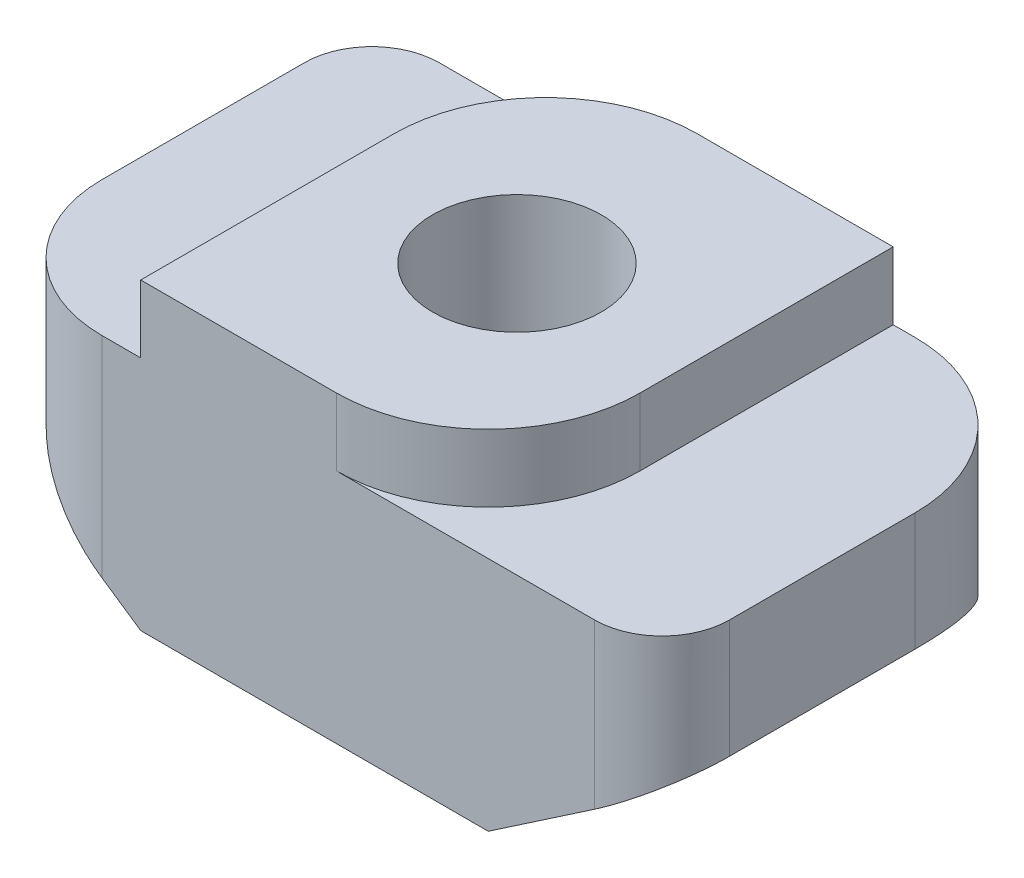
ISO-10303-21;
HEADER;
FILE_DESCRIPTION(('STEP AP214'),'2;1');
FILE_NAME('part.step','',(''),(''),'','','');
FILE_SCHEMA(('AUTOMOTIVE_DESIGN { 1 0 10303 214 1 1 1 1 }'));
ENDSEC;
DATA;
#1=APPLICATION_CONTEXT('core data for automotive mechanical design processes');
#2=APPLICATION_PROTOCOL_DEFINITION('international standard','automotive_design',2000,#1);
#3=PRODUCT_CONTEXT('',#1,'mechanical');
#4=PRODUCT('Part','Part','',(#3));
#5=PRODUCT_RELATED_PRODUCT_CATEGORY('part','',(#4));
#6=PRODUCT_DEFINITION_FORMATION('','',#4);
#7=PRODUCT_DEFINITION_CONTEXT('part definition',#1,'design');
#8=PRODUCT_DEFINITION('design','',#6,#7);
#9=PRODUCT_DEFINITION_SHAPE('','',#8);
#10=(LENGTH_UNIT() NAMED_UNIT(*) SI_UNIT(.MILLI.,.METRE.));
#11=(NAMED_UNIT(*) PLANE_ANGLE_UNIT() SI_UNIT($,.RADIAN.));
#12=(NAMED_UNIT(*) SI_UNIT($,.STERADIAN.) SOLID_ANGLE_UNIT());
#13=UNCERTAINTY_MEASURE_WITH_UNIT(LENGTH_MEASURE(1.E-05),#10,'distance_accuracy_value','');
#14=(GEOMETRIC_REPRESENTATION_CONTEXT(3) GLOBAL_UNCERTAINTY_ASSIGNED_CONTEXT((#13)) GLOBAL_UNIT_ASSIGNED_CONTEXT((#10,
#11,#12)) REPRESENTATION_CONTEXT('',''));
#15=CARTESIAN_POINT('',(0.,0.,0.));
#16=DIRECTION('',(0.,0.,1.));
#17=DIRECTION('',(1.,0.,0.));
#18=AXIS2_PLACEMENT_3D('',#15,#16,#17);
#19=CARTESIAN_POINT('',(-5.15,1.75,6.));
#20=DIRECTION('',(1.,0.,0.));
#21=DIRECTION('',(0.,1.,0.));
#22=AXIS2_PLACEMENT_3D('',#19,#20,#21);
#23=PLANE('',#22);
#24=DIRECTION('',(0.,0.,-1.));
#25=VECTOR('',#24,1.);
#26=CARTESIAN_POINT('',(-5.15,0.,6.));
#27=LINE('',#26,#25);
#28=CARTESIAN_POINT('',(-5.15,0.,4.));
#29=VERTEX_POINT('',#28);
#30=CARTESIAN_POINT('',(-5.15,0.,1.));
#31=VERTEX_POINT('',#30);
#32=EDGE_CURVE('E180',#29,#31,#27,.T.);
#33=ORIENTED_EDGE('',*,*,#32,.F.);
#34=DIRECTION('',(0.,-1.,0.));
#35=VECTOR('',#34,1.);
#36=CARTESIAN_POINT('',(-5.15,1.75,4.));
#37=LINE('',#36,#35);
#38=CARTESIAN_POINT('',(-5.15,1.75,4.));
#39=VERTEX_POINT('',#38);
#40=EDGE_CURVE('E277',#29,#39,#37,.F.);
#41=ORIENTED_EDGE('',*,*,#40,.T.);
#42=DIRECTION('',(0.,0.,-1.));
#43=VECTOR('',#42,1.);
#44=CARTESIAN_POINT('',(-5.15,1.75,6.));
#45=LINE('',#44,#43);
#46=CARTESIAN_POINT('',(-5.15,1.75,1.));
#47=VERTEX_POINT('',#46);
#48=EDGE_CURVE('E204',#39,#47,#45,.T.);
#49=ORIENTED_EDGE('',*,*,#48,.T.);
#50=DIRECTION('',(0.,-1.,0.));
#51=VECTOR('',#50,1.);
#52=CARTESIAN_POINT('',(-5.15,1.75,1.));
#53=LINE('',#52,#51);
#54=EDGE_CURVE('E258',#47,#31,#53,.T.);
#55=ORIENTED_EDGE('',*,*,#54,.T.);
#56=EDGE_LOOP('',(#33,#41,#49,#55));
#57=FACE_BOUND('',#56,.T.);
#58=ADVANCED_FACE('F43',(#57),#23,.F.);
#59=CARTESIAN_POINT('',(-5.15,0.,6.));
#60=DIRECTION('',(0.562090366387661,0.827075824827558,0.));
#61=DIRECTION('',(-0.827075824827558,0.562090366387661,0.));
#62=AXIS2_PLACEMENT_3D('',#59,#60,#61);
#63=PLANE('',#62);
#64=DIRECTION('',(0.827075824827558,-0.562090366387661,0.));
#65=VECTOR('',#64,1.);
#66=CARTESIAN_POINT('',(-5.15,0.,6.));
#67=LINE('',#66,#65);
#68=CARTESIAN_POINT('',(-3.15,-1.35922330097088,6.));
#69=VERTEX_POINT('',#68);
#70=CARTESIAN_POINT('',(-2.575,-1.75,6.));
#71=VERTEX_POINT('',#70);
#72=EDGE_CURVE('E158',#69,#71,#67,.T.);
#73=ORIENTED_EDGE('',*,*,#72,.F.);
#74=CARTESIAN_POINT('',(-3.15,-1.35922330097088,4.));
#75=DIRECTION('',(0.562090366387661,0.827075824827558,0.));
#76=DIRECTION('',(-0.827075824827558,0.562090366387661,0.));
#77=AXIS2_PLACEMENT_3D('',#74,#75,#76);
#78=ELLIPSE('',#77,2.41815797290048,2.);
#79=EDGE_CURVE('E274',#69,#29,#78,.F.);
#80=ORIENTED_EDGE('',*,*,#79,.T.);
#81=ORIENTED_EDGE('',*,*,#32,.T.);
#82=CARTESIAN_POINT('',(-4.15,-0.679611650485438,1.));
#83=DIRECTION('',(0.562090366387661,0.827075824827558,0.));
#84=DIRECTION('',(0.827075824827558,-0.562090366387661,0.));
#85=AXIS2_PLACEMENT_3D('',#82,#83,#84);
#86=ELLIPSE('',#85,1.20907898645024,1.);
#87=CARTESIAN_POINT('',(-4.15,-0.679611650485438,0.));
#88=VERTEX_POINT('',#87);
#89=EDGE_CURVE('E262',#31,#88,#86,.F.);
#90=ORIENTED_EDGE('',*,*,#89,.T.);
#91=DIRECTION('',(0.827075824827558,-0.562090366387661,0.));
#92=VECTOR('',#91,1.);
#93=CARTESIAN_POINT('',(-5.15,0.,0.));
#94=LINE('',#93,#92);
#95=CARTESIAN_POINT('',(-2.575,-1.75,0.));
#96=VERTEX_POINT('',#95);
#97=EDGE_CURVE('E176',#88,#96,#94,.T.);
#98=ORIENTED_EDGE('',*,*,#97,.T.);
#99=DIRECTION('',(0.,0.,-1.));
#100=VECTOR('',#99,1.);
#101=CARTESIAN_POINT('',(-2.575,-1.75,6.));
#102=LINE('',#101,#100);
#103=EDGE_CURVE('E173',#71,#96,#102,.T.);
#104=ORIENTED_EDGE('',*,*,#103,.F.);
#105=EDGE_LOOP('',(#73,#80,#81,#90,#98,#104));
#106=FACE_BOUND('',#105,.T.);
#107=ADVANCED_FACE('F174',(#106),#63,.F.);
#108=CARTESIAN_POINT('',(-2.575,-1.75,6.));
#109=DIRECTION('',(0.,1.,0.));
#110=DIRECTION('',(-1.,0.,0.));
#111=AXIS2_PLACEMENT_3D('',#108,#109,#110);
#112=PLANE('',#111);
#113=CARTESIAN_POINT('',(0.,-1.75,3.));
#114=DIRECTION('',(0.,1.,0.));
#115=DIRECTION('',(0.,0.,1.));
#116=AXIS2_PLACEMENT_3D('',#113,#114,#115);
#117=CIRCLE('',#116,1.25);
#118=CARTESIAN_POINT('',(0.,-1.75,4.25));
#119=VERTEX_POINT('',#118);
#120=EDGE_CURVE('E208',#119,#119,#117,.T.);
#121=ORIENTED_EDGE('',*,*,#120,.T.);
#122=EDGE_LOOP('',(#121));
#123=FACE_BOUND('',#122,.T.);
#124=DIRECTION('',(1.,0.,0.));
#125=VECTOR('',#124,1.);
#126=CARTESIAN_POINT('',(-2.575,-1.75,0.));
#127=LINE('',#126,#125);
#128=CARTESIAN_POINT('',(2.575,-1.75,0.));
#129=VERTEX_POINT('',#128);
#130=EDGE_CURVE('E207',#96,#129,#127,.T.);
#131=ORIENTED_EDGE('',*,*,#130,.T.);
#132=DIRECTION('',(0.,0.,-1.));
#133=VECTOR('',#132,1.);
#134=CARTESIAN_POINT('',(2.575,-1.75,6.));
#135=LINE('',#134,#133);
#136=CARTESIAN_POINT('',(2.575,-1.75,6.));
#137=VERTEX_POINT('',#136);
#138=EDGE_CURVE('E181',#137,#129,#135,.T.);
#139=ORIENTED_EDGE('',*,*,#138,.F.);
#140=DIRECTION('',(1.,0.,0.));
#141=VECTOR('',#140,1.);
#142=CARTESIAN_POINT('',(-2.575,-1.75,6.));
#143=LINE('',#142,#141);
#144=EDGE_CURVE('E163',#71,#137,#143,.T.);
#145=ORIENTED_EDGE('',*,*,#144,.F.);
#146=ORIENTED_EDGE('',*,*,#103,.T.);
#147=EDGE_LOOP('',(#131,#139,#145,#146));
#148=FACE_BOUND('',#147,.T.);
#149=ADVANCED_FACE('F183',(#123,#148),#112,.F.);
#150=CARTESIAN_POINT('',(5.15,0.,6.));
#151=DIRECTION('',(-0.562090366387662,0.827075824827557,0.));
#152=DIRECTION('',(-0.827075824827557,-0.562090366387662,0.));
#153=AXIS2_PLACEMENT_3D('',#150,#151,#152);
#154=PLANE('',#153);
#155=DIRECTION('',(0.827075824827557,0.562090366387662,0.));
#156=VECTOR('',#155,1.);
#157=CARTESIAN_POINT('',(5.15,0.,0.));
#158=LINE('',#157,#156);
#159=CARTESIAN_POINT('',(2.89999999999999,-1.52912621359224,0.));
#160=VERTEX_POINT('',#159);
#161=EDGE_CURVE('E211',#129,#160,#158,.T.);
#162=ORIENTED_EDGE('',*,*,#161,.T.);
#163=CARTESIAN_POINT('',(2.89999999999999,-1.52912621359224,2.25));
#164=DIRECTION('',(-0.562090366387662,0.827075824827557,0.));
#165=DIRECTION('',(0.827075824827557,0.562090366387662,0.));
#166=AXIS2_PLACEMENT_3D('',#163,#164,#165);
#167=ELLIPSE('',#166,2.72042771951305,2.25);
#168=CARTESIAN_POINT('',(5.15,0.,2.25));
#169=VERTEX_POINT('',#168);
#170=EDGE_CURVE('E305',#160,#169,#167,.F.);
#171=ORIENTED_EDGE('',*,*,#170,.T.);
#172=DIRECTION('',(0.,0.,-1.));
#173=VECTOR('',#172,1.);
#174=CARTESIAN_POINT('',(5.15,0.,6.));
#175=LINE('',#174,#173);
#176=CARTESIAN_POINT('',(5.15,0.,5.));
#177=VERTEX_POINT('',#176);
#178=EDGE_CURVE('E250',#177,#169,#175,.T.);
#179=ORIENTED_EDGE('',*,*,#178,.F.);
#180=CARTESIAN_POINT('',(4.15,-0.679611650485438,5.));
#181=DIRECTION('',(-0.562090366387662,0.827075824827557,0.));
#182=DIRECTION('',(-0.827075824827557,-0.562090366387662,0.));
#183=AXIS2_PLACEMENT_3D('',#180,#181,#182);
#184=ELLIPSE('',#183,1.20907898645024,1.);
#185=CARTESIAN_POINT('',(4.15,-0.679611650485439,6.));
#186=VERTEX_POINT('',#185);
#187=EDGE_CURVE('E292',#177,#186,#184,.F.);
#188=ORIENTED_EDGE('',*,*,#187,.T.);
#189=DIRECTION('',(0.827075824827557,0.562090366387662,0.));
#190=VECTOR('',#189,1.);
#191=CARTESIAN_POINT('',(5.15,0.,6.));
#192=LINE('',#191,#190);
#193=EDGE_CURVE('E187',#137,#186,#192,.T.);
#194=ORIENTED_EDGE('',*,*,#193,.F.);
#195=ORIENTED_EDGE('',*,*,#138,.T.);
#196=EDGE_LOOP('',(#162,#171,#179,#188,#194,#195));
#197=FACE_BOUND('',#196,.T.);
#198=ADVANCED_FACE('F357',(#197),#154,.F.);
#199=CARTESIAN_POINT('',(5.15,1.75,6.));
#200=DIRECTION('',(-1.,0.,0.));
#201=DIRECTION('',(0.,-1.,0.));
#202=AXIS2_PLACEMENT_3D('',#199,#200,#201);
#203=PLANE('',#202);
#204=ORIENTED_EDGE('',*,*,#178,.T.);
#205=DIRECTION('',(0.,1.,0.));
#206=VECTOR('',#205,1.);
#207=CARTESIAN_POINT('',(5.15,1.75,2.25));
#208=LINE('',#207,#206);
#209=CARTESIAN_POINT('',(5.15,1.75,2.25));
#210=VERTEX_POINT('',#209);
#211=EDGE_CURVE('E295',#169,#210,#208,.T.);
#212=ORIENTED_EDGE('',*,*,#211,.T.);
#213=DIRECTION('',(0.,0.,-1.));
#214=VECTOR('',#213,1.);
#215=CARTESIAN_POINT('',(5.15,1.75,6.));
#216=LINE('',#215,#214);
#217=CARTESIAN_POINT('',(5.15,1.75,5.));
#218=VERTEX_POINT('',#217);
#219=EDGE_CURVE('E246',#218,#210,#216,.T.);
#220=ORIENTED_EDGE('',*,*,#219,.F.);
#221=DIRECTION('',(0.,1.,0.));
#222=VECTOR('',#221,1.);
#223=CARTESIAN_POINT('',(5.15,0.,5.));
#224=LINE('',#223,#222);
#225=EDGE_CURVE('E289',#218,#177,#224,.F.);
#226=ORIENTED_EDGE('',*,*,#225,.T.);
#227=EDGE_LOOP('',(#204,#212,#220,#226));
#228=FACE_BOUND('',#227,.T.);
#229=ADVANCED_FACE('F360',(#228),#203,.F.);
#230=CARTESIAN_POINT('',(2.575,1.75,6.));
#231=DIRECTION('',(0.,-1.,0.));
#232=DIRECTION('',(1.,0.,0.));
#233=AXIS2_PLACEMENT_3D('',#230,#231,#232);
#234=PLANE('',#233);
#235=ORIENTED_EDGE('',*,*,#219,.T.);
#236=CARTESIAN_POINT('',(2.9,1.75,2.25));
#237=DIRECTION('',(0.,-1.,0.));
#238=DIRECTION('',(1.,0.,0.));
#239=AXIS2_PLACEMENT_3D('',#236,#237,#238);
#240=CIRCLE('',#239,2.25);
#241=CARTESIAN_POINT('',(2.9,1.75,0.));
#242=VERTEX_POINT('',#241);
#243=EDGE_CURVE('E299',#210,#242,#240,.F.);
#244=ORIENTED_EDGE('',*,*,#243,.T.);
#245=DIRECTION('',(-1.,0.,0.));
#246=VECTOR('',#245,1.);
#247=CARTESIAN_POINT('',(2.575,1.75,0.));
#248=LINE('',#247,#246);
#249=CARTESIAN_POINT('',(2.575,1.75,0.));
#250=VERTEX_POINT('',#249);
#251=EDGE_CURVE('E215',#242,#250,#248,.T.);
#252=ORIENTED_EDGE('',*,*,#251,.T.);
#253=DIRECTION('',(0.,0.,-1.));
#254=VECTOR('',#253,1.);
#255=CARTESIAN_POINT('',(2.575,1.75,6.));
#256=LINE('',#255,#254);
#257=CARTESIAN_POINT('',(2.575,1.75,3.75));
#258=VERTEX_POINT('',#257);
#259=EDGE_CURVE('E243',#258,#250,#256,.T.);
#260=ORIENTED_EDGE('',*,*,#259,.F.);
#261=CARTESIAN_POINT('',(0.325,1.75,3.75));
#262=DIRECTION('',(0.,-1.,0.));
#263=DIRECTION('',(1.,0.,0.));
#264=AXIS2_PLACEMENT_3D('',#261,#262,#263);
#265=CIRCLE('',#264,2.25);
#266=CARTESIAN_POINT('',(0.325,1.75,6.));
#267=VERTEX_POINT('',#266);
#268=EDGE_CURVE('E11',#258,#267,#265,.T.);
#269=ORIENTED_EDGE('',*,*,#268,.T.);
#270=DIRECTION('',(-1.,0.,0.));
#271=VECTOR('',#270,1.);
#272=CARTESIAN_POINT('',(2.575,1.75,6.));
#273=LINE('',#272,#271);
#274=CARTESIAN_POINT('',(4.15,1.75,6.));
#275=VERTEX_POINT('',#274);
#276=EDGE_CURVE('E67',#275,#267,#273,.T.);
#277=ORIENTED_EDGE('',*,*,#276,.F.);
#278=CARTESIAN_POINT('',(4.15,1.75,5.));
#279=DIRECTION('',(0.,-1.,0.));
#280=DIRECTION('',(1.,0.,0.));
#281=AXIS2_PLACEMENT_3D('',#278,#279,#280);
#282=CIRCLE('',#281,1.);
#283=EDGE_CURVE('E286',#275,#218,#282,.F.);
#284=ORIENTED_EDGE('',*,*,#283,.T.);
#285=EDGE_LOOP('',(#235,#244,#252,#260,#269,#277,#284));
#286=FACE_BOUND('',#285,.T.);
#287=ADVANCED_FACE('F366',(#286),#234,.F.);
#288=CARTESIAN_POINT('',(2.575,2.75,6.));
#289=DIRECTION('',(-1.,0.,0.));
#290=DIRECTION('',(0.,-1.,0.));
#291=AXIS2_PLACEMENT_3D('',#288,#289,#290);
#292=PLANE('',#291);
#293=DIRECTION('',(0.,0.,-1.));
#294=VECTOR('',#293,1.);
#295=CARTESIAN_POINT('',(2.575,2.75,6.));
#296=LINE('',#295,#294);
#297=CARTESIAN_POINT('',(2.575,2.75,3.75));
#298=VERTEX_POINT('',#297);
#299=CARTESIAN_POINT('',(2.575,2.75,0.));
#300=VERTEX_POINT('',#299);
#301=EDGE_CURVE('E240',#298,#300,#296,.T.);
#302=ORIENTED_EDGE('',*,*,#301,.F.);
#303=DIRECTION('',(0.,1.,0.));
#304=VECTOR('',#303,1.);
#305=CARTESIAN_POINT('',(2.575,1.75,3.75));
#306=LINE('',#305,#304);
#307=EDGE_CURVE('E59',#298,#258,#306,.F.);
#308=ORIENTED_EDGE('',*,*,#307,.T.);
#309=ORIENTED_EDGE('',*,*,#259,.T.);
#310=DIRECTION('',(0.,1.,0.));
#311=VECTOR('',#310,1.);
#312=CARTESIAN_POINT('',(2.575,2.75,0.));
#313=LINE('',#312,#311);
#314=EDGE_CURVE('E219',#250,#300,#313,.T.);
#315=ORIENTED_EDGE('',*,*,#314,.T.);
#316=EDGE_LOOP('',(#302,#308,#309,#315));
#317=FACE_BOUND('',#316,.T.);
#318=ADVANCED_FACE('F346',(#317),#292,.F.);
#319=CARTESIAN_POINT('',(-2.575,2.75,6.));
#320=DIRECTION('',(0.,-1.,0.));
#321=DIRECTION('',(1.,0.,0.));
#322=AXIS2_PLACEMENT_3D('',#319,#320,#321);
#323=PLANE('',#322);
#324=CARTESIAN_POINT('',(0.,2.75,3.));
#325=DIRECTION('',(0.,1.,0.));
#326=DIRECTION('',(0.,0.,1.));
#327=AXIS2_PLACEMENT_3D('',#324,#325,#326);
#328=CIRCLE('',#327,1.24999999999999);
#329=CARTESIAN_POINT('',(0.,2.75,4.24999999999999));
#330=VERTEX_POINT('',#329);
#331=EDGE_CURVE('E548',#330,#330,#328,.T.);
#332=ORIENTED_EDGE('',*,*,#331,.F.);
#333=EDGE_LOOP('',(#332));
#334=FACE_BOUND('',#333,.T.);
#335=DIRECTION('',(-1.,0.,0.));
#336=VECTOR('',#335,1.);
#337=CARTESIAN_POINT('',(-2.575,2.75,0.));
#338=LINE('',#337,#336);
#339=CARTESIAN_POINT('',(-0.325000000000001,2.75,0.));
#340=VERTEX_POINT('',#339);
#341=EDGE_CURVE('E223',#300,#340,#338,.T.);
#342=ORIENTED_EDGE('',*,*,#341,.T.);
#343=CARTESIAN_POINT('',(-0.325,2.75,2.25));
#344=DIRECTION('',(0.,-1.,0.));
#345=DIRECTION('',(1.,0.,0.));
#346=AXIS2_PLACEMENT_3D('',#343,#344,#345);
#347=CIRCLE('',#346,2.25);
#348=CARTESIAN_POINT('',(-2.575,2.75,2.25));
#349=VERTEX_POINT('',#348);
#350=EDGE_CURVE('E318',#340,#349,#347,.F.);
#351=ORIENTED_EDGE('',*,*,#350,.T.);
#352=DIRECTION('',(0.,0.,-1.));
#353=VECTOR('',#352,1.);
#354=CARTESIAN_POINT('',(-2.575,2.75,6.));
#355=LINE('',#354,#353);
#356=CARTESIAN_POINT('',(-2.575,2.75,6.));
#357=VERTEX_POINT('',#356);
#358=EDGE_CURVE('E236',#357,#349,#355,.T.);
#359=ORIENTED_EDGE('',*,*,#358,.F.);
#360=DIRECTION('',(-1.,0.,0.));
#361=VECTOR('',#360,1.);
#362=CARTESIAN_POINT('',(-2.575,2.75,6.));
#363=LINE('',#362,#361);
#364=CARTESIAN_POINT('',(0.324999999999999,2.75,6.));
#365=VERTEX_POINT('',#364);
#366=EDGE_CURVE('E195',#365,#357,#363,.T.);
#367=ORIENTED_EDGE('',*,*,#366,.F.);
#368=CARTESIAN_POINT('',(0.325,2.75,3.75));
#369=DIRECTION('',(0.,-1.,0.));
#370=DIRECTION('',(1.,0.,0.));
#371=AXIS2_PLACEMENT_3D('',#368,#369,#370);
#372=CIRCLE('',#371,2.25);
#373=EDGE_CURVE('E315',#365,#298,#372,.F.);
#374=ORIENTED_EDGE('',*,*,#373,.T.);
#375=ORIENTED_EDGE('',*,*,#301,.T.);
#376=EDGE_LOOP('',(#342,#351,#359,#367,#374,#375));
#377=FACE_BOUND('',#376,.T.);
#378=ADVANCED_FACE('F343',(#334,#377),#323,.F.);
#379=CARTESIAN_POINT('',(-2.575,1.75,6.));
#380=DIRECTION('',(1.,0.,0.));
#381=DIRECTION('',(0.,1.,0.));
#382=AXIS2_PLACEMENT_3D('',#379,#380,#381);
#383=PLANE('',#382);
#384=ORIENTED_EDGE('',*,*,#358,.T.);
#385=DIRECTION('',(0.,-1.,0.));
#386=VECTOR('',#385,1.);
#387=CARTESIAN_POINT('',(-2.575,1.75,2.25));
#388=LINE('',#387,#386);
#389=CARTESIAN_POINT('',(-2.575,1.75,2.25));
#390=VERTEX_POINT('',#389);
#391=EDGE_CURVE('E308',#349,#390,#388,.T.);
#392=ORIENTED_EDGE('',*,*,#391,.T.);
#393=DIRECTION('',(0.,0.,-1.));
#394=VECTOR('',#393,1.);
#395=CARTESIAN_POINT('',(-2.575,1.75,6.));
#396=LINE('',#395,#394);
#397=CARTESIAN_POINT('',(-2.575,1.75,6.));
#398=VERTEX_POINT('',#397);
#399=EDGE_CURVE('E232',#398,#390,#396,.T.);
#400=ORIENTED_EDGE('',*,*,#399,.F.);
#401=DIRECTION('',(0.,-1.,0.));
#402=VECTOR('',#401,1.);
#403=CARTESIAN_POINT('',(-2.575,1.75,6.));
#404=LINE('',#403,#402);
#405=EDGE_CURVE('E198',#357,#398,#404,.T.);
#406=ORIENTED_EDGE('',*,*,#405,.F.);
#407=EDGE_LOOP('',(#384,#392,#400,#406));
#408=FACE_BOUND('',#407,.T.);
#409=ADVANCED_FACE('F372',(#408),#383,.F.);
#410=CARTESIAN_POINT('',(-5.15,1.75,6.));
#411=DIRECTION('',(0.,-1.,0.));
#412=DIRECTION('',(1.,0.,0.));
#413=AXIS2_PLACEMENT_3D('',#410,#411,#412);
#414=PLANE('',#413);
#415=ORIENTED_EDGE('',*,*,#48,.F.);
#416=CARTESIAN_POINT('',(-3.15,1.75,4.));
#417=DIRECTION('',(0.,-1.,0.));
#418=DIRECTION('',(1.,0.,0.));
#419=AXIS2_PLACEMENT_3D('',#416,#417,#418);
#420=CIRCLE('',#419,2.);
#421=CARTESIAN_POINT('',(-3.15,1.75,6.));
#422=VERTEX_POINT('',#421);
#423=EDGE_CURVE('E280',#39,#422,#420,.F.);
#424=ORIENTED_EDGE('',*,*,#423,.T.);
#425=DIRECTION('',(-1.,0.,0.));
#426=VECTOR('',#425,1.);
#427=CARTESIAN_POINT('',(-5.15,1.75,6.));
#428=LINE('',#427,#426);
#429=EDGE_CURVE('E201',#398,#422,#428,.T.);
#430=ORIENTED_EDGE('',*,*,#429,.F.);
#431=ORIENTED_EDGE('',*,*,#399,.T.);
#432=CARTESIAN_POINT('',(-0.325,1.75,2.25));
#433=DIRECTION('',(0.,-1.,0.));
#434=DIRECTION('',(1.,0.,0.));
#435=AXIS2_PLACEMENT_3D('',#432,#433,#434);
#436=CIRCLE('',#435,2.25);
#437=CARTESIAN_POINT('',(-0.325,1.75,0.));
#438=VERTEX_POINT('',#437);
#439=EDGE_CURVE('E52',#390,#438,#436,.T.);
#440=ORIENTED_EDGE('',*,*,#439,.T.);
#441=DIRECTION('',(-1.,0.,0.));
#442=VECTOR('',#441,1.);
#443=CARTESIAN_POINT('',(-5.15,1.75,0.));
#444=LINE('',#443,#442);
#445=CARTESIAN_POINT('',(-4.15,1.75,0.));
#446=VERTEX_POINT('',#445);
#447=EDGE_CURVE('E170',#438,#446,#444,.T.);
#448=ORIENTED_EDGE('',*,*,#447,.T.);
#449=CARTESIAN_POINT('',(-4.15,1.75,1.));
#450=DIRECTION('',(0.,-1.,0.));
#451=DIRECTION('',(1.,0.,0.));
#452=AXIS2_PLACEMENT_3D('',#449,#450,#451);
#453=CIRCLE('',#452,1.);
#454=EDGE_CURVE('E268',#446,#47,#453,.F.);
#455=ORIENTED_EDGE('',*,*,#454,.T.);
#456=EDGE_LOOP('',(#415,#424,#430,#431,#440,#448,#455));
#457=FACE_BOUND('',#456,.T.);
#458=ADVANCED_FACE('F330',(#457),#414,.F.);
#459=CARTESIAN_POINT('',(0.,0.,6.));
#460=DIRECTION('',(0.,0.,1.));
#461=DIRECTION('',(1.,0.,0.));
#462=AXIS2_PLACEMENT_3D('',#459,#460,#461);
#463=PLANE('',#462);
#464=ORIENTED_EDGE('',*,*,#276,.T.);
#465=DIRECTION('',(0.,1.,0.));
#466=VECTOR('',#465,1.);
#467=CARTESIAN_POINT('',(0.325,2.75,6.));
#468=LINE('',#467,#466);
#469=EDGE_CURVE('E321',#267,#365,#468,.T.);
#470=ORIENTED_EDGE('',*,*,#469,.T.);
#471=ORIENTED_EDGE('',*,*,#366,.T.);
#472=ORIENTED_EDGE('',*,*,#405,.T.);
#473=ORIENTED_EDGE('',*,*,#429,.T.);
#474=DIRECTION('',(0.,-1.,0.));
#475=VECTOR('',#474,1.);
#476=CARTESIAN_POINT('',(-3.15,0.,6.));
#477=LINE('',#476,#475);
#478=EDGE_CURVE('E167',#422,#69,#477,.T.);
#479=ORIENTED_EDGE('',*,*,#478,.T.);
#480=ORIENTED_EDGE('',*,*,#72,.T.);
#481=ORIENTED_EDGE('',*,*,#144,.T.);
#482=ORIENTED_EDGE('',*,*,#193,.T.);
#483=DIRECTION('',(0.,1.,0.));
#484=VECTOR('',#483,1.);
#485=CARTESIAN_POINT('',(4.15,1.75,6.));
#486=LINE('',#485,#484);
#487=EDGE_CURVE('E283',#186,#275,#486,.T.);
#488=ORIENTED_EDGE('',*,*,#487,.T.);
#489=EDGE_LOOP('',(#464,#470,#471,#472,#473,#479,#480,#481,#482,#488));
#490=FACE_BOUND('',#489,.T.);
#491=ADVANCED_FACE('F160',(#490),#463,.T.);
#492=CARTESIAN_POINT('',(0.,0.,0.));
#493=DIRECTION('',(0.,0.,1.));
#494=DIRECTION('',(1.,0.,0.));
#495=AXIS2_PLACEMENT_3D('',#492,#493,#494);
#496=PLANE('',#495);
#497=ORIENTED_EDGE('',*,*,#447,.F.);
#498=DIRECTION('',(0.,-1.,0.));
#499=VECTOR('',#498,1.);
#500=CARTESIAN_POINT('',(-0.324999999999999,0.,0.));
#501=LINE('',#500,#499);
#502=EDGE_CURVE('E312',#438,#340,#501,.F.);
#503=ORIENTED_EDGE('',*,*,#502,.T.);
#504=ORIENTED_EDGE('',*,*,#341,.F.);
#505=ORIENTED_EDGE('',*,*,#314,.F.);
#506=ORIENTED_EDGE('',*,*,#251,.F.);
#507=DIRECTION('',(0.,1.,0.));
#508=VECTOR('',#507,1.);
#509=CARTESIAN_POINT('',(2.9,0.,0.));
#510=LINE('',#509,#508);
#511=EDGE_CURVE('E302',#242,#160,#510,.F.);
#512=ORIENTED_EDGE('',*,*,#511,.T.);
#513=ORIENTED_EDGE('',*,*,#161,.F.);
#514=ORIENTED_EDGE('',*,*,#130,.F.);
#515=ORIENTED_EDGE('',*,*,#97,.F.);
#516=DIRECTION('',(0.,-1.,0.));
#517=VECTOR('',#516,1.);
#518=CARTESIAN_POINT('',(-4.15,0.,0.));
#519=LINE('',#518,#517);
#520=EDGE_CURVE('E265',#88,#446,#519,.F.);
#521=ORIENTED_EDGE('',*,*,#520,.T.);
#522=EDGE_LOOP('',(#497,#503,#504,#505,#506,#512,#513,#514,#515,#521));
#523=FACE_BOUND('',#522,.T.);
#524=ADVANCED_FACE('F340',(#523),#496,.F.);
#525=CARTESIAN_POINT('',(0.,2.75,3.));
#526=DIRECTION('',(0.,1.,0.));
#527=DIRECTION('',(0.,0.,1.));
#528=AXIS2_PLACEMENT_3D('',#525,#526,#527);
#529=CYLINDRICAL_SURFACE('',#528,1.24999999999999);
#530=ORIENTED_EDGE('',*,*,#120,.F.);
#531=EDGE_LOOP('',(#530));
#532=FACE_BOUND('',#531,.T.);
#533=ORIENTED_EDGE('',*,*,#331,.T.);
#534=EDGE_LOOP('',(#533));
#535=FACE_BOUND('',#534,.T.);
#536=ADVANCED_FACE('F385',(#532,#535),#529,.F.);
#537=CARTESIAN_POINT('',(-4.15,1.75,1.));
#538=DIRECTION('',(0.,-1.,0.));
#539=DIRECTION('',(1.,0.,0.));
#540=AXIS2_PLACEMENT_3D('',#537,#538,#539);
#541=CYLINDRICAL_SURFACE('',#540,1.);
#542=ORIENTED_EDGE('',*,*,#454,.F.);
#543=ORIENTED_EDGE('',*,*,#520,.F.);
#544=ORIENTED_EDGE('',*,*,#89,.F.);
#545=ORIENTED_EDGE('',*,*,#54,.F.);
#546=EDGE_LOOP('',(#542,#543,#544,#545));
#547=FACE_BOUND('',#546,.T.);
#548=ADVANCED_FACE('F382',(#547),#541,.T.);
#549=CARTESIAN_POINT('',(-3.15,0.,4.));
#550=DIRECTION('',(0.,1.,0.));
#551=DIRECTION('',(-1.,0.,0.));
#552=AXIS2_PLACEMENT_3D('',#549,#550,#551);
#553=CYLINDRICAL_SURFACE('',#552,2.);
#554=ORIENTED_EDGE('',*,*,#423,.F.);
#555=ORIENTED_EDGE('',*,*,#40,.F.);
#556=ORIENTED_EDGE('',*,*,#79,.F.);
#557=ORIENTED_EDGE('',*,*,#478,.F.);
#558=EDGE_LOOP('',(#554,#555,#556,#557));
#559=FACE_BOUND('',#558,.T.);
#560=ADVANCED_FACE('F375',(#559),#553,.T.);
#561=CARTESIAN_POINT('',(4.15,0.,5.));
#562=DIRECTION('',(0.,-1.,0.));
#563=DIRECTION('',(1.,0.,0.));
#564=AXIS2_PLACEMENT_3D('',#561,#562,#563);
#565=CYLINDRICAL_SURFACE('',#564,1.);
#566=ORIENTED_EDGE('',*,*,#187,.F.);
#567=ORIENTED_EDGE('',*,*,#225,.F.);
#568=ORIENTED_EDGE('',*,*,#283,.F.);
#569=ORIENTED_EDGE('',*,*,#487,.F.);
#570=EDGE_LOOP('',(#566,#567,#568,#569));
#571=FACE_BOUND('',#570,.T.);
#572=ADVANCED_FACE('F364',(#571),#565,.T.);
#573=CARTESIAN_POINT('',(2.9,1.75000000000001,2.25));
#574=DIRECTION('',(0.,1.,0.));
#575=DIRECTION('',(-1.,0.,0.));
#576=AXIS2_PLACEMENT_3D('',#573,#574,#575);
#577=CYLINDRICAL_SURFACE('',#576,2.25);
#578=ORIENTED_EDGE('',*,*,#170,.F.);
#579=ORIENTED_EDGE('',*,*,#511,.F.);
#580=ORIENTED_EDGE('',*,*,#243,.F.);
#581=ORIENTED_EDGE('',*,*,#211,.F.);
#582=EDGE_LOOP('',(#578,#579,#580,#581));
#583=FACE_BOUND('',#582,.T.);
#584=ADVANCED_FACE('F353',(#583),#577,.T.);
#585=CARTESIAN_POINT('',(-0.325,1.75,2.25));
#586=DIRECTION('',(0.,-1.,0.));
#587=DIRECTION('',(1.,0.,0.));
#588=AXIS2_PLACEMENT_3D('',#585,#586,#587);
#589=CYLINDRICAL_SURFACE('',#588,2.25);
#590=ORIENTED_EDGE('',*,*,#350,.F.);
#591=ORIENTED_EDGE('',*,*,#502,.F.);
#592=ORIENTED_EDGE('',*,*,#439,.F.);
#593=ORIENTED_EDGE('',*,*,#391,.F.);
#594=EDGE_LOOP('',(#590,#591,#592,#593));
#595=FACE_BOUND('',#594,.T.);
#596=ADVANCED_FACE('F337',(#595),#589,.T.);
#597=CARTESIAN_POINT('',(0.324999999999999,0.,3.75));
#598=DIRECTION('',(0.,-1.,0.));
#599=DIRECTION('',(1.,0.,0.));
#600=AXIS2_PLACEMENT_3D('',#597,#598,#599);
#601=CYLINDRICAL_SURFACE('',#600,2.25);
#602=ORIENTED_EDGE('',*,*,#268,.F.);
#603=ORIENTED_EDGE('',*,*,#307,.F.);
#604=ORIENTED_EDGE('',*,*,#373,.F.);
#605=ORIENTED_EDGE('',*,*,#469,.F.);
#606=EDGE_LOOP('',(#602,#603,#604,#605));
#607=FACE_BOUND('',#606,.T.);
#608=ADVANCED_FACE('F45',(#607),#601,.T.);
#609=CLOSED_SHELL('',(#58,#107,#149,#198,#229,#287,#318,#378,#409,#458,#491,#524,#536,#548,#560,
#572,#584,#596,#608));
#610=MANIFOLD_SOLID_BREP('B2',#609);
#611=ADVANCED_BREP_SHAPE_REPRESENTATION('',(#18,#610),#14);
#612=SHAPE_DEFINITION_REPRESENTATION(#9,#611);
ENDSEC;
END-ISO-10303-21;
